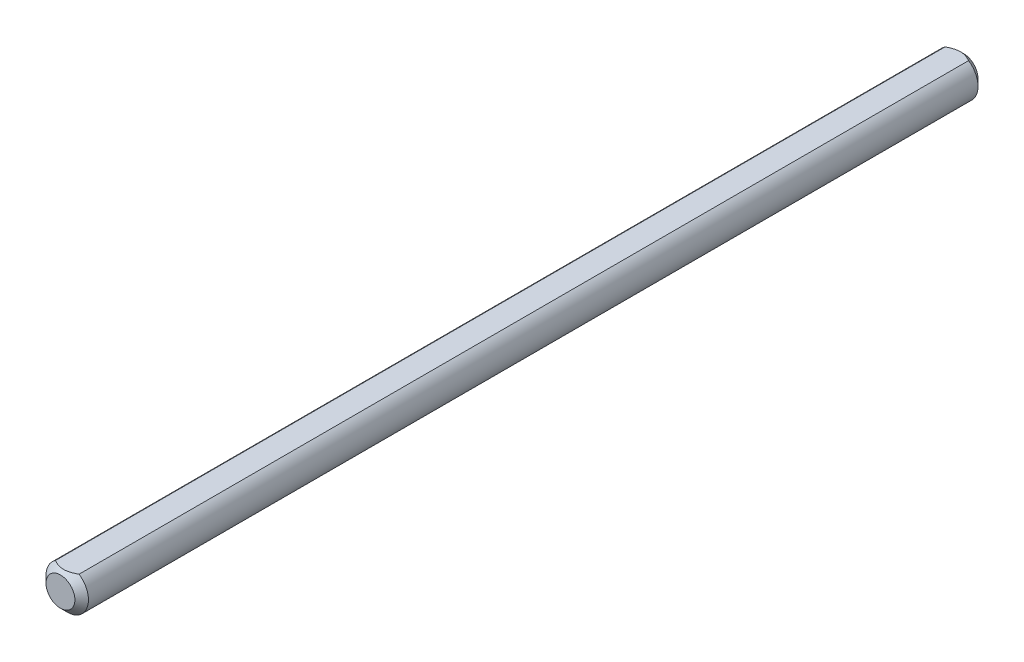
ISO-10303-21;
HEADER;
FILE_DESCRIPTION(('STEP AP214'),'2;1');
FILE_NAME('part.step','',(''),(''),'','','');
FILE_SCHEMA(('AUTOMOTIVE_DESIGN { 1 0 10303 214 1 1 1 1 }'));
ENDSEC;
DATA;
#1=APPLICATION_CONTEXT('core data for automotive mechanical design processes');
#2=APPLICATION_PROTOCOL_DEFINITION('international standard','automotive_design',2000,#1);
#3=PRODUCT_CONTEXT('',#1,'mechanical');
#4=PRODUCT('Part','Part','',(#3));
#5=PRODUCT_RELATED_PRODUCT_CATEGORY('part','',(#4));
#6=PRODUCT_DEFINITION_FORMATION('','',#4);
#7=PRODUCT_DEFINITION_CONTEXT('part definition',#1,'design');
#8=PRODUCT_DEFINITION('design','',#6,#7);
#9=PRODUCT_DEFINITION_SHAPE('','',#8);
#10=(LENGTH_UNIT() NAMED_UNIT(*) SI_UNIT(.MILLI.,.METRE.));
#11=(NAMED_UNIT(*) PLANE_ANGLE_UNIT() SI_UNIT($,.RADIAN.));
#12=(NAMED_UNIT(*) SI_UNIT($,.STERADIAN.) SOLID_ANGLE_UNIT());
#13=UNCERTAINTY_MEASURE_WITH_UNIT(LENGTH_MEASURE(1.E-05),#10,'distance_accuracy_value','');
#14=(GEOMETRIC_REPRESENTATION_CONTEXT(3) GLOBAL_UNCERTAINTY_ASSIGNED_CONTEXT((#13)) GLOBAL_UNIT_ASSIGNED_CONTEXT((#10,
#11,#12)) REPRESENTATION_CONTEXT('',''));
#15=CARTESIAN_POINT('',(0.,0.,0.));
#16=DIRECTION('',(0.,0.,1.));
#17=DIRECTION('',(1.,0.,0.));
#18=AXIS2_PLACEMENT_3D('',#15,#16,#17);
#19=CARTESIAN_POINT('',(0.,0.,50.));
#20=DIRECTION('',(0.,0.,-1.));
#21=DIRECTION('',(-1.,0.,0.));
#22=AXIS2_PLACEMENT_3D('',#19,#20,#21);
#23=CYLINDRICAL_SURFACE('',#22,2.35);
#24=DIRECTION('',(0.,0.,-1.));
#25=VECTOR('',#24,1.);
#26=CARTESIAN_POINT('',(-1.3114877048604,1.95,50.));
#27=LINE('',#26,#25);
#28=CARTESIAN_POINT('',(-1.3114877048604,1.95,49.25));
#29=VERTEX_POINT('',#28);
#30=CARTESIAN_POINT('',(-1.3114877048604,1.95,-49.25));
#31=VERTEX_POINT('',#30);
#32=EDGE_CURVE('E63',#29,#31,#27,.T.);
#33=ORIENTED_EDGE('',*,*,#32,.T.);
#34=CARTESIAN_POINT('',(0.,0.,-49.25));
#35=DIRECTION('',(0.,0.,1.));
#36=DIRECTION('',(1.,0.,0.));
#37=AXIS2_PLACEMENT_3D('',#34,#35,#36);
#38=CIRCLE('',#37,2.35);
#39=CARTESIAN_POINT('',(1.3114877048604,1.95,-49.25));
#40=VERTEX_POINT('',#39);
#41=EDGE_CURVE('E69',#31,#40,#38,.T.);
#42=ORIENTED_EDGE('',*,*,#41,.T.);
#43=DIRECTION('',(0.,0.,-1.));
#44=VECTOR('',#43,1.);
#45=CARTESIAN_POINT('',(1.3114877048604,1.95,50.));
#46=LINE('',#45,#44);
#47=CARTESIAN_POINT('',(1.3114877048604,1.95,49.25));
#48=VERTEX_POINT('',#47);
#49=EDGE_CURVE('E61',#48,#40,#46,.T.);
#50=ORIENTED_EDGE('',*,*,#49,.F.);
#51=CARTESIAN_POINT('',(0.,0.,49.25));
#52=DIRECTION('',(0.,0.,1.));
#53=DIRECTION('',(1.,0.,0.));
#54=AXIS2_PLACEMENT_3D('',#51,#52,#53);
#55=CIRCLE('',#54,2.35);
#56=EDGE_CURVE('E73',#48,#29,#55,.F.);
#57=ORIENTED_EDGE('',*,*,#56,.T.);
#58=EDGE_LOOP('',(#33,#42,#50,#57));
#59=FACE_BOUND('',#58,.T.);
#60=ADVANCED_FACE('F15',(#59),#23,.T.);
#61=CARTESIAN_POINT('',(-1.3114877048604,1.95,50.));
#62=DIRECTION('',(0.,-1.,0.));
#63=DIRECTION('',(0.,0.,-1.));
#64=AXIS2_PLACEMENT_3D('',#61,#62,#63);
#65=PLANE('',#64);
#66=ORIENTED_EDGE('',*,*,#49,.T.);
#67=CARTESIAN_POINT('',(1.3114877048604,1.95,-49.25));
#68=CARTESIAN_POINT('',(1.24186199444796,1.95,-49.2888158696779));
#69=CARTESIAN_POINT('',(1.17130329140962,1.95,-49.326101718488));
#70=CARTESIAN_POINT('',(1.02783437678537,1.95,-49.3965993175705));
#71=CARTESIAN_POINT('',(0.954915763003836,1.95,-49.4297938677541));
#72=CARTESIAN_POINT('',(0.805991356015541,1.95,-49.4910948167953));
#73=CARTESIAN_POINT('',(0.729960444715383,1.95,-49.519141298958));
#74=CARTESIAN_POINT('',(0.575711028024666,1.95,-49.5681007524976));
#75=CARTESIAN_POINT('',(0.49749618157976,1.95,-49.589024961777));
#76=CARTESIAN_POINT('',(0.360978386819576,1.95,-49.617664514546));
#77=CARTESIAN_POINT('',(0.303105604510432,1.95,-49.6274292319169));
#78=CARTESIAN_POINT('',(0.18671962364787,1.95,-49.6419310295506));
#79=CARTESIAN_POINT('',(0.128206415569034,1.95,-49.6466680349303));
#80=CARTESIAN_POINT('',(0.0115200314193226,1.95,-49.6508297947768));
#81=CARTESIAN_POINT('',(-0.046651419980883,1.95,-49.6503023067153));
#82=CARTESIAN_POINT('',(-0.162716592673164,1.95,-49.6440818693524));
#83=CARTESIAN_POINT('',(-0.220610285115983,1.95,-49.6383883946854));
#84=CARTESIAN_POINT('',(-0.34906447523194,1.95,-49.6202468816242));
#85=CARTESIAN_POINT('',(-0.419446914389773,1.95,-49.6065380309769));
#86=CARTESIAN_POINT('',(-0.558653641788181,1.95,-49.5726808654368));
#87=CARTESIAN_POINT('',(-0.627476943525191,1.95,-49.5525285891314));
#88=CARTESIAN_POINT('',(-0.764534879058738,1.95,-49.5064938168894));
#89=CARTESIAN_POINT('',(-0.832736594698738,1.95,-49.4805146681783));
#90=CARTESIAN_POINT('',(-0.967245947080051,1.95,-49.424146331387));
#91=CARTESIAN_POINT('',(-1.03355405327676,1.95,-49.3937582479119));
#92=CARTESIAN_POINT('',(-1.20886446981586,1.95,-49.3076956887888));
#93=CARTESIAN_POINT('',(-1.31630507737133,1.95,-49.2488552621813));
#94=CARTESIAN_POINT('',(-1.52730447073885,1.95,-49.1245397963735));
#95=CARTESIAN_POINT('',(-1.63085989578133,1.95,-49.0590591866429));
#96=CARTESIAN_POINT('',(-1.83533451507397,1.95,-48.9232302368669));
#97=CARTESIAN_POINT('',(-1.93624073237519,1.95,-48.8528625113958));
#98=CARTESIAN_POINT('',(-2.13562726377783,1.95,-48.7088656813812));
#99=CARTESIAN_POINT('',(-2.2341083959493,1.95,-48.6352377007597));
#100=CARTESIAN_POINT('',(-2.42012123747307,1.95,-48.4925454146577));
#101=CARTESIAN_POINT('',(-2.5078180279153,1.95,-48.4236952932647));
#102=CARTESIAN_POINT('',(-2.68199106609513,1.95,-48.2844545520023));
#103=CARTESIAN_POINT('',(-2.768467193594,1.95,-48.2140637820926));
#104=CARTESIAN_POINT('',(-2.93961307290672,1.95,-48.0727473569071));
#105=CARTESIAN_POINT('',(-3.02429216714775,1.95,-48.0018329859336));
#106=CARTESIAN_POINT('',(-3.19282127637192,1.95,-47.8590594695849));
#107=CARTESIAN_POINT('',(-3.27667145612247,1.95,-47.7872005188646));
#108=CARTESIAN_POINT('',(-3.36019867555159,1.95,-47.7149729551548));
#109=B_SPLINE_CURVE_WITH_KNOTS('',3,(#67,#68,#69,#70,#71,#72,#73,#74,#75,#76,#77,#78,#79,#80,
#81,#82,#83,#84,#85,#86,#87,#88,#89,#90,#91,#92,#93,#94,#95,#96,#97,#98,#99,#100,#101,#102,#103,
#104,#105,#106,#107,#108),.UNSPECIFIED.,.F.,.F.,(4,2,2,2,2,2,2,2,2,2,2,2,2,2,2,2,2,2,2,2,4),(0.,
0.239229764027319,0.479433240807002,0.722276086029543,0.964733965120973,1.14061111964141,
1.31649089364783,1.49077661442204,1.66508006152483,1.87983034477809,2.09471291101512,
2.3134650018718,2.53216238138604,2.89926429818476,3.26667676978265,3.63564054868732,
4.00447810854721,4.33894128420769,4.67343717870465,5.00478221917662,5.33606001584434),.UNSPECIFIED.);
#110=EDGE_CURVE('E68',#40,#31,#109,.T.);
#111=ORIENTED_EDGE('',*,*,#110,.T.);
#112=ORIENTED_EDGE('',*,*,#32,.F.);
#113=CARTESIAN_POINT('',(-1.3114877048604,1.95,49.25));
#114=CARTESIAN_POINT('',(-1.24186199444796,1.95,49.2888158696779));
#115=CARTESIAN_POINT('',(-1.17130329140962,1.95,49.326101718488));
#116=CARTESIAN_POINT('',(-1.02783437678538,1.95,49.3965993175704));
#117=CARTESIAN_POINT('',(-0.954915763003839,1.95,49.4297938677541));
#118=CARTESIAN_POINT('',(-0.805991356015543,1.95,49.4910948167953));
#119=CARTESIAN_POINT('',(-0.729960444715386,1.95,49.519141298958));
#120=CARTESIAN_POINT('',(-0.57571102802467,1.95,49.5681007524975));
#121=CARTESIAN_POINT('',(-0.497496181579765,1.95,49.5890249617769));
#122=CARTESIAN_POINT('',(-0.360978386819584,1.95,49.617664514546));
#123=CARTESIAN_POINT('',(-0.303105604510441,1.95,49.6274292319169));
#124=CARTESIAN_POINT('',(-0.186719623647882,1.95,49.6419310295505));
#125=CARTESIAN_POINT('',(-0.128206415569046,1.95,49.6466680349303));
#126=CARTESIAN_POINT('',(-0.0115200314193359,1.95,49.6508297947768));
#127=CARTESIAN_POINT('',(0.0466514199808689,1.95,49.6503023067153));
#128=CARTESIAN_POINT('',(0.162716592673148,1.95,49.6440818693523));
#129=CARTESIAN_POINT('',(0.220610285115966,1.95,49.6383883946854));
#130=CARTESIAN_POINT('',(0.349064475231921,1.95,49.6202468816242));
#131=CARTESIAN_POINT('',(0.419446914389752,1.95,49.6065380309768));
#132=CARTESIAN_POINT('',(0.558653641788157,1.95,49.5726808654367));
#133=CARTESIAN_POINT('',(0.627476943525165,1.95,49.5525285891313));
#134=CARTESIAN_POINT('',(0.76453487905871,1.95,49.5064938168894));
#135=CARTESIAN_POINT('',(0.832736594698709,1.95,49.4805146681783));
#136=CARTESIAN_POINT('',(0.967245947080019,1.95,49.424146331387));
#137=CARTESIAN_POINT('',(1.03355405327673,1.95,49.3937582479119));
#138=CARTESIAN_POINT('',(1.20886446981582,1.95,49.3076956887888));
#139=CARTESIAN_POINT('',(1.31630507737128,1.95,49.2488552621813));
#140=CARTESIAN_POINT('',(1.52730447073879,1.95,49.1245397963735));
#141=CARTESIAN_POINT('',(1.63085989578127,1.95,49.059059186643));
#142=CARTESIAN_POINT('',(1.8353345150739,1.95,48.9232302368669));
#143=CARTESIAN_POINT('',(1.93624073237512,1.95,48.8528625113958));
#144=CARTESIAN_POINT('',(2.13562726377775,1.95,48.7088656813812));
#145=CARTESIAN_POINT('',(2.23410839594921,1.95,48.6352377007597));
#146=CARTESIAN_POINT('',(2.42012123747297,1.95,48.4925454146577));
#147=CARTESIAN_POINT('',(2.50781802791519,1.95,48.4236952932647));
#148=CARTESIAN_POINT('',(2.68199106609501,1.95,48.2844545520023));
#149=CARTESIAN_POINT('',(2.76846719359388,1.95,48.2140637820926));
#150=CARTESIAN_POINT('',(2.9396130729066,1.95,48.0727473569072));
#151=CARTESIAN_POINT('',(3.02429216714762,1.95,48.0018329859337));
#152=CARTESIAN_POINT('',(3.19282127637178,1.95,47.859059469585));
#153=CARTESIAN_POINT('',(3.27667145612232,1.95,47.7872005188647));
#154=CARTESIAN_POINT('',(3.36019867555144,1.95,47.7149729551549));
#155=B_SPLINE_CURVE_WITH_KNOTS('',3,(#113,#114,#115,#116,#117,#118,#119,#120,#121,#122,#123,
#124,#125,#126,#127,#128,#129,#130,#131,#132,#133,#134,#135,#136,#137,#138,#139,#140,#141,#142,
#143,#144,#145,#146,#147,#148,#149,#150,#151,#152,#153,#154),.UNSPECIFIED.,.F.,.F.,(4,2,2,2,2,2,
2,2,2,2,2,2,2,2,2,2,2,2,2,2,4),(0.,0.239229764027318,0.479433240806999,0.722276086029544,
0.964733965120967,1.1406111196414,1.31649089364782,1.49077661442203,1.66508006152482,
1.87983034477807,2.09471291101509,2.31346500187177,2.53216238138601,2.8992642981847,
3.26667676978257,3.63564054868723,4.0044781085471,4.33894128420755,4.6734371787045,
5.00478221917645,5.33606001584415),.UNSPECIFIED.);
#156=EDGE_CURVE('E58',#29,#48,#155,.T.);
#157=ORIENTED_EDGE('',*,*,#156,.T.);
#158=EDGE_LOOP('',(#66,#111,#112,#157));
#159=FACE_BOUND('',#158,.T.);
#160=ADVANCED_FACE('F60',(#159),#65,.F.);
#161=CARTESIAN_POINT('',(0.,0.,50.));
#162=DIRECTION('',(0.,0.,1.));
#163=DIRECTION('',(1.,0.,0.));
#164=AXIS2_PLACEMENT_3D('',#161,#162,#163);
#165=PLANE('',#164);
#166=CARTESIAN_POINT('',(0.,0.,50.));
#167=DIRECTION('',(0.,0.,1.));
#168=DIRECTION('',(1.,0.,0.));
#169=AXIS2_PLACEMENT_3D('',#166,#167,#168);
#170=CIRCLE('',#169,1.6);
#171=CARTESIAN_POINT('',(-0.892927799053891,1.32765957446809,50.));
#172=VERTEX_POINT('',#171);
#173=EDGE_CURVE('E10',#172,#172,#170,.T.);
#174=ORIENTED_EDGE('',*,*,#173,.T.);
#175=EDGE_LOOP('',(#174));
#176=FACE_BOUND('',#175,.T.);
#177=ADVANCED_FACE('F96',(#176),#165,.T.);
#178=CARTESIAN_POINT('',(0.,0.,-50.));
#179=DIRECTION('',(0.,0.,1.));
#180=DIRECTION('',(1.,0.,0.));
#181=AXIS2_PLACEMENT_3D('',#178,#179,#180);
#182=PLANE('',#181);
#183=CARTESIAN_POINT('',(0.,0.,-50.));
#184=DIRECTION('',(0.,0.,1.));
#185=DIRECTION('',(1.,0.,0.));
#186=AXIS2_PLACEMENT_3D('',#183,#184,#185);
#187=CIRCLE('',#186,1.60000000000002);
#188=CARTESIAN_POINT('',(-0.892927799053899,1.3276595744681,-50.));
#189=VERTEX_POINT('',#188);
#190=EDGE_CURVE('E25',#189,#189,#187,.F.);
#191=ORIENTED_EDGE('',*,*,#190,.T.);
#192=EDGE_LOOP('',(#191));
#193=FACE_BOUND('',#192,.T.);
#194=ADVANCED_FACE('F97',(#193),#182,.F.);
#195=CARTESIAN_POINT('',(0.,0.,-49.25));
#196=DIRECTION('',(0.,0.,1.));
#197=DIRECTION('',(1.,0.,0.));
#198=AXIS2_PLACEMENT_3D('',#195,#196,#197);
#199=CONICAL_SURFACE('',#198,2.35,0.785398163397454);
#200=ORIENTED_EDGE('',*,*,#190,.F.);
#201=EDGE_LOOP('',(#200));
#202=FACE_BOUND('',#201,.T.);
#203=ORIENTED_EDGE('',*,*,#110,.F.);
#204=ORIENTED_EDGE('',*,*,#41,.F.);
#205=EDGE_LOOP('',(#203,#204));
#206=FACE_BOUND('',#205,.T.);
#207=ADVANCED_FACE('F101',(#202,#206),#199,.T.);
#208=CARTESIAN_POINT('',(0.,0.,50.));
#209=DIRECTION('',(0.,0.,-1.));
#210=DIRECTION('',(-1.,0.,0.));
#211=AXIS2_PLACEMENT_3D('',#208,#209,#210);
#212=CONICAL_SURFACE('',#211,1.6,0.785398163397448);
#213=ORIENTED_EDGE('',*,*,#156,.F.);
#214=ORIENTED_EDGE('',*,*,#56,.F.);
#215=EDGE_LOOP('',(#213,#214));
#216=FACE_BOUND('',#215,.T.);
#217=ORIENTED_EDGE('',*,*,#173,.F.);
#218=EDGE_LOOP('',(#217));
#219=FACE_BOUND('',#218,.T.);
#220=ADVANCED_FACE('F17',(#216,#219),#212,.T.);
#221=CLOSED_SHELL('',(#60,#160,#177,#194,#207,#220));
#222=MANIFOLD_SOLID_BREP('B1',#221);
#223=ADVANCED_BREP_SHAPE_REPRESENTATION('',(#18,#222),#14);
#224=SHAPE_DEFINITION_REPRESENTATION(#9,#223);
ENDSEC;
END-ISO-10303-21;
